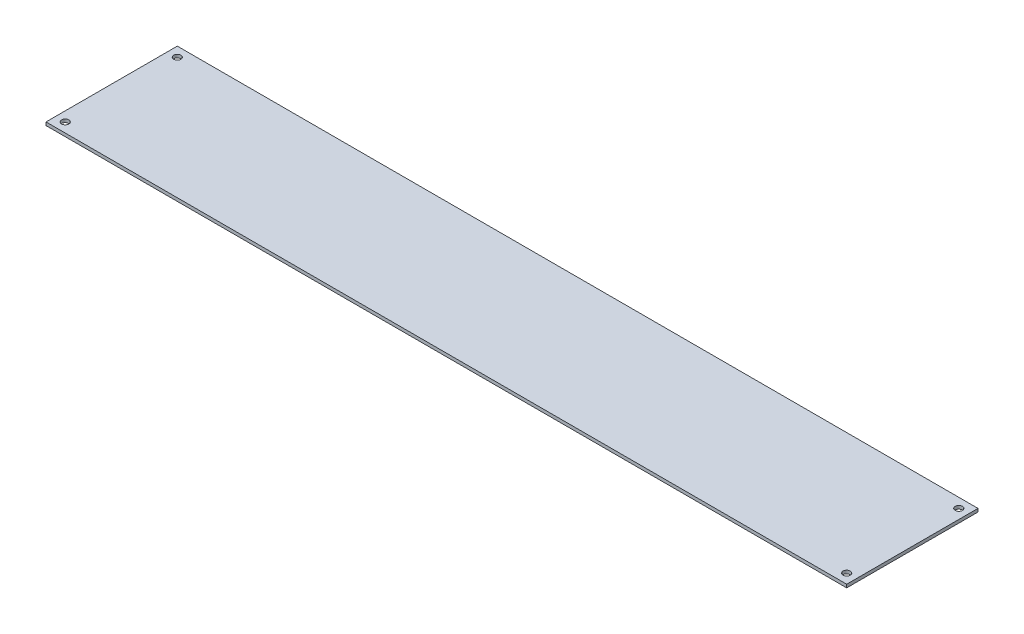
ISO-10303-21;
HEADER;
FILE_DESCRIPTION(('STEP AP214'),'2;1');
FILE_NAME('part.step','',(''),(''),'','','');
FILE_SCHEMA(('AUTOMOTIVE_DESIGN { 1 0 10303 214 1 1 1 1 }'));
ENDSEC;
DATA;
#1=APPLICATION_CONTEXT('core data for automotive mechanical design processes');
#2=APPLICATION_PROTOCOL_DEFINITION('international standard','automotive_design',2000,#1);
#3=PRODUCT_CONTEXT('',#1,'mechanical');
#4=PRODUCT('Part','Part','',(#3));
#5=PRODUCT_RELATED_PRODUCT_CATEGORY('part','',(#4));
#6=PRODUCT_DEFINITION_FORMATION('','',#4);
#7=PRODUCT_DEFINITION_CONTEXT('part definition',#1,'design');
#8=PRODUCT_DEFINITION('design','',#6,#7);
#9=PRODUCT_DEFINITION_SHAPE('','',#8);
#10=(LENGTH_UNIT() NAMED_UNIT(*) SI_UNIT(.MILLI.,.METRE.));
#11=(NAMED_UNIT(*) PLANE_ANGLE_UNIT() SI_UNIT($,.RADIAN.));
#12=(NAMED_UNIT(*) SI_UNIT($,.STERADIAN.) SOLID_ANGLE_UNIT());
#13=UNCERTAINTY_MEASURE_WITH_UNIT(LENGTH_MEASURE(1.E-05),#10,'distance_accuracy_value','');
#14=(GEOMETRIC_REPRESENTATION_CONTEXT(3) GLOBAL_UNCERTAINTY_ASSIGNED_CONTEXT((#13)) GLOBAL_UNIT_ASSIGNED_CONTEXT((#10,
#11,#12)) REPRESENTATION_CONTEXT('',''));
#15=CARTESIAN_POINT('',(0.,0.,0.));
#16=DIRECTION('',(0.,0.,1.));
#17=DIRECTION('',(1.,0.,0.));
#18=AXIS2_PLACEMENT_3D('',#15,#16,#17);
#19=CARTESIAN_POINT('',(0.,2.,0.));
#20=DIRECTION('',(1.,0.,0.));
#21=DIRECTION('',(0.,0.,-1.));
#22=AXIS2_PLACEMENT_3D('',#19,#20,#21);
#23=PLANE('',#22);
#24=DIRECTION('',(0.,0.,1.));
#25=VECTOR('',#24,1.);
#26=CARTESIAN_POINT('',(0.,0.,0.));
#27=LINE('',#26,#25);
#28=CARTESIAN_POINT('',(0.,0.,-82.));
#29=VERTEX_POINT('',#28);
#30=CARTESIAN_POINT('',(0.,0.,0.));
#31=VERTEX_POINT('',#30);
#32=EDGE_CURVE('E97',#29,#31,#27,.T.);
#33=ORIENTED_EDGE('',*,*,#32,.T.);
#34=DIRECTION('',(0.,-1.,0.));
#35=VECTOR('',#34,1.);
#36=CARTESIAN_POINT('',(0.,2.,0.));
#37=LINE('',#36,#35);
#38=CARTESIAN_POINT('',(0.,2.,0.));
#39=VERTEX_POINT('',#38);
#40=EDGE_CURVE('E11',#39,#31,#37,.T.);
#41=ORIENTED_EDGE('',*,*,#40,.F.);
#42=DIRECTION('',(0.,0.,1.));
#43=VECTOR('',#42,1.);
#44=CARTESIAN_POINT('',(0.,2.,0.));
#45=LINE('',#44,#43);
#46=CARTESIAN_POINT('',(0.,2.,-82.));
#47=VERTEX_POINT('',#46);
#48=EDGE_CURVE('E85',#47,#39,#45,.T.);
#49=ORIENTED_EDGE('',*,*,#48,.F.);
#50=DIRECTION('',(0.,-1.,0.));
#51=VECTOR('',#50,1.);
#52=CARTESIAN_POINT('',(0.,2.,-82.));
#53=LINE('',#52,#51);
#54=EDGE_CURVE('E93',#47,#29,#53,.T.);
#55=ORIENTED_EDGE('',*,*,#54,.T.);
#56=EDGE_LOOP('',(#33,#41,#49,#55));
#57=FACE_BOUND('',#56,.T.);
#58=ADVANCED_FACE('F34',(#57),#23,.F.);
#59=CARTESIAN_POINT('',(0.,2.,0.));
#60=DIRECTION('',(0.,0.,-1.));
#61=DIRECTION('',(-1.,0.,0.));
#62=AXIS2_PLACEMENT_3D('',#59,#60,#61);
#63=PLANE('',#62);
#64=DIRECTION('',(1.,0.,0.));
#65=VECTOR('',#64,1.);
#66=CARTESIAN_POINT('',(0.,0.,0.));
#67=LINE('',#66,#65);
#68=CARTESIAN_POINT('',(500.,0.,0.));
#69=VERTEX_POINT('',#68);
#70=EDGE_CURVE('E89',#31,#69,#67,.T.);
#71=ORIENTED_EDGE('',*,*,#70,.T.);
#72=DIRECTION('',(0.,-1.,0.));
#73=VECTOR('',#72,1.);
#74=CARTESIAN_POINT('',(500.,2.,0.));
#75=LINE('',#74,#73);
#76=CARTESIAN_POINT('',(500.,2.,0.));
#77=VERTEX_POINT('',#76);
#78=EDGE_CURVE('E42',#77,#69,#75,.T.);
#79=ORIENTED_EDGE('',*,*,#78,.F.);
#80=DIRECTION('',(1.,0.,0.));
#81=VECTOR('',#80,1.);
#82=CARTESIAN_POINT('',(0.,2.,0.));
#83=LINE('',#82,#81);
#84=EDGE_CURVE('E80',#39,#77,#83,.T.);
#85=ORIENTED_EDGE('',*,*,#84,.F.);
#86=ORIENTED_EDGE('',*,*,#40,.T.);
#87=EDGE_LOOP('',(#71,#79,#85,#86));
#88=FACE_BOUND('',#87,.T.);
#89=ADVANCED_FACE('F88',(#88),#63,.F.);
#90=CARTESIAN_POINT('',(500.,2.,0.));
#91=DIRECTION('',(-1.,0.,0.));
#92=DIRECTION('',(0.,0.,1.));
#93=AXIS2_PLACEMENT_3D('',#90,#91,#92);
#94=PLANE('',#93);
#95=DIRECTION('',(0.,0.,-1.));
#96=VECTOR('',#95,1.);
#97=CARTESIAN_POINT('',(500.,0.,0.));
#98=LINE('',#97,#96);
#99=CARTESIAN_POINT('',(500.,0.,-82.));
#100=VERTEX_POINT('',#99);
#101=EDGE_CURVE('E67',#69,#100,#98,.T.);
#102=ORIENTED_EDGE('',*,*,#101,.T.);
#103=DIRECTION('',(0.,-1.,0.));
#104=VECTOR('',#103,1.);
#105=CARTESIAN_POINT('',(500.,2.,-82.));
#106=LINE('',#105,#104);
#107=CARTESIAN_POINT('',(500.,2.,-82.));
#108=VERTEX_POINT('',#107);
#109=EDGE_CURVE('E90',#108,#100,#106,.T.);
#110=ORIENTED_EDGE('',*,*,#109,.F.);
#111=DIRECTION('',(0.,0.,-1.));
#112=VECTOR('',#111,1.);
#113=CARTESIAN_POINT('',(500.,2.,0.));
#114=LINE('',#113,#112);
#115=EDGE_CURVE('E83',#77,#108,#114,.T.);
#116=ORIENTED_EDGE('',*,*,#115,.F.);
#117=ORIENTED_EDGE('',*,*,#78,.T.);
#118=EDGE_LOOP('',(#102,#110,#116,#117));
#119=FACE_BOUND('',#118,.T.);
#120=ADVANCED_FACE('F91',(#119),#94,.F.);
#121=CARTESIAN_POINT('',(0.,2.,-82.));
#122=DIRECTION('',(0.,0.,1.));
#123=DIRECTION('',(1.,0.,0.));
#124=AXIS2_PLACEMENT_3D('',#121,#122,#123);
#125=PLANE('',#124);
#126=DIRECTION('',(-1.,0.,0.));
#127=VECTOR('',#126,1.);
#128=CARTESIAN_POINT('',(0.,0.,-82.));
#129=LINE('',#128,#127);
#130=EDGE_CURVE('E73',#100,#29,#129,.T.);
#131=ORIENTED_EDGE('',*,*,#130,.T.);
#132=ORIENTED_EDGE('',*,*,#54,.F.);
#133=DIRECTION('',(-1.,0.,0.));
#134=VECTOR('',#133,1.);
#135=CARTESIAN_POINT('',(0.,2.,-82.));
#136=LINE('',#135,#134);
#137=EDGE_CURVE('E50',#108,#47,#136,.T.);
#138=ORIENTED_EDGE('',*,*,#137,.F.);
#139=ORIENTED_EDGE('',*,*,#109,.T.);
#140=EDGE_LOOP('',(#131,#132,#138,#139));
#141=FACE_BOUND('',#140,.T.);
#142=ADVANCED_FACE('F105',(#141),#125,.F.);
#143=CARTESIAN_POINT('',(0.,2.,0.));
#144=DIRECTION('',(0.,-1.,0.));
#145=DIRECTION('',(0.,0.,-1.));
#146=AXIS2_PLACEMENT_3D('',#143,#144,#145);
#147=PLANE('',#146);
#148=CARTESIAN_POINT('',(6.00000000000001,2.,-6.));
#149=DIRECTION('',(0.,-1.,0.));
#150=DIRECTION('',(0.,0.,-1.));
#151=AXIS2_PLACEMENT_3D('',#148,#149,#150);
#152=CIRCLE('',#151,2.25);
#153=CARTESIAN_POINT('',(6.00000000000001,2.,-8.25));
#154=VERTEX_POINT('',#153);
#155=EDGE_CURVE('E128',#154,#154,#152,.T.);
#156=ORIENTED_EDGE('',*,*,#155,.T.);
#157=EDGE_LOOP('',(#156));
#158=FACE_BOUND('',#157,.T.);
#159=CARTESIAN_POINT('',(6.00000000000001,2.,-76.));
#160=DIRECTION('',(0.,-1.,0.));
#161=DIRECTION('',(0.,0.,-1.));
#162=AXIS2_PLACEMENT_3D('',#159,#160,#161);
#163=CIRCLE('',#162,2.25);
#164=CARTESIAN_POINT('',(6.00000000000001,2.,-78.25));
#165=VERTEX_POINT('',#164);
#166=EDGE_CURVE('E122',#165,#165,#163,.T.);
#167=ORIENTED_EDGE('',*,*,#166,.T.);
#168=EDGE_LOOP('',(#167));
#169=FACE_BOUND('',#168,.T.);
#170=CARTESIAN_POINT('',(494.,2.,-76.));
#171=DIRECTION('',(0.,-1.,0.));
#172=DIRECTION('',(0.,0.,-1.));
#173=AXIS2_PLACEMENT_3D('',#170,#171,#172);
#174=CIRCLE('',#173,2.24999999999997);
#175=CARTESIAN_POINT('',(494.,2.,-78.25));
#176=VERTEX_POINT('',#175);
#177=EDGE_CURVE('E116',#176,#176,#174,.T.);
#178=ORIENTED_EDGE('',*,*,#177,.T.);
#179=EDGE_LOOP('',(#178));
#180=FACE_BOUND('',#179,.T.);
#181=CARTESIAN_POINT('',(494.,2.,-6.));
#182=DIRECTION('',(0.,-1.,0.));
#183=DIRECTION('',(0.,0.,-1.));
#184=AXIS2_PLACEMENT_3D('',#181,#182,#183);
#185=CIRCLE('',#184,2.24999999999997);
#186=CARTESIAN_POINT('',(494.,2.,-8.24999999999998));
#187=VERTEX_POINT('',#186);
#188=EDGE_CURVE('E100',#187,#187,#185,.T.);
#189=ORIENTED_EDGE('',*,*,#188,.T.);
#190=EDGE_LOOP('',(#189));
#191=FACE_BOUND('',#190,.T.);
#192=ORIENTED_EDGE('',*,*,#48,.T.);
#193=ORIENTED_EDGE('',*,*,#84,.T.);
#194=ORIENTED_EDGE('',*,*,#115,.T.);
#195=ORIENTED_EDGE('',*,*,#137,.T.);
#196=EDGE_LOOP('',(#192,#193,#194,#195));
#197=FACE_BOUND('',#196,.T.);
#198=ADVANCED_FACE('F81',(#158,#169,#180,#191,#197),#147,.F.);
#199=CARTESIAN_POINT('',(0.,0.,0.));
#200=DIRECTION('',(0.,-1.,0.));
#201=DIRECTION('',(0.,0.,-1.));
#202=AXIS2_PLACEMENT_3D('',#199,#200,#201);
#203=PLANE('',#202);
#204=CARTESIAN_POINT('',(6.00000000000001,0.,-6.));
#205=DIRECTION('',(0.,-1.,0.));
#206=DIRECTION('',(0.,0.,-1.));
#207=AXIS2_PLACEMENT_3D('',#204,#205,#206);
#208=CIRCLE('',#207,2.25);
#209=CARTESIAN_POINT('',(6.00000000000001,0.,-8.25));
#210=VERTEX_POINT('',#209);
#211=EDGE_CURVE('E131',#210,#210,#208,.T.);
#212=ORIENTED_EDGE('',*,*,#211,.F.);
#213=EDGE_LOOP('',(#212));
#214=FACE_BOUND('',#213,.T.);
#215=CARTESIAN_POINT('',(6.00000000000001,0.,-76.));
#216=DIRECTION('',(0.,-1.,0.));
#217=DIRECTION('',(0.,0.,-1.));
#218=AXIS2_PLACEMENT_3D('',#215,#216,#217);
#219=CIRCLE('',#218,2.25);
#220=CARTESIAN_POINT('',(6.00000000000001,0.,-78.25));
#221=VERTEX_POINT('',#220);
#222=EDGE_CURVE('E125',#221,#221,#219,.T.);
#223=ORIENTED_EDGE('',*,*,#222,.F.);
#224=EDGE_LOOP('',(#223));
#225=FACE_BOUND('',#224,.T.);
#226=CARTESIAN_POINT('',(494.,0.,-76.));
#227=DIRECTION('',(0.,-1.,0.));
#228=DIRECTION('',(0.,0.,-1.));
#229=AXIS2_PLACEMENT_3D('',#226,#227,#228);
#230=CIRCLE('',#229,2.24999999999997);
#231=CARTESIAN_POINT('',(494.,0.,-78.25));
#232=VERTEX_POINT('',#231);
#233=EDGE_CURVE('E119',#232,#232,#230,.T.);
#234=ORIENTED_EDGE('',*,*,#233,.F.);
#235=EDGE_LOOP('',(#234));
#236=FACE_BOUND('',#235,.T.);
#237=CARTESIAN_POINT('',(494.,0.,-6.));
#238=DIRECTION('',(0.,-1.,0.));
#239=DIRECTION('',(0.,0.,-1.));
#240=AXIS2_PLACEMENT_3D('',#237,#238,#239);
#241=CIRCLE('',#240,2.24999999999997);
#242=CARTESIAN_POINT('',(494.,0.,-8.24999999999998));
#243=VERTEX_POINT('',#242);
#244=EDGE_CURVE('E113',#243,#243,#241,.T.);
#245=ORIENTED_EDGE('',*,*,#244,.F.);
#246=EDGE_LOOP('',(#245));
#247=FACE_BOUND('',#246,.T.);
#248=ORIENTED_EDGE('',*,*,#32,.F.);
#249=ORIENTED_EDGE('',*,*,#130,.F.);
#250=ORIENTED_EDGE('',*,*,#101,.F.);
#251=ORIENTED_EDGE('',*,*,#70,.F.);
#252=EDGE_LOOP('',(#248,#249,#250,#251));
#253=FACE_BOUND('',#252,.T.);
#254=ADVANCED_FACE('F108',(#214,#225,#236,#247,#253),#203,.T.);
#255=CARTESIAN_POINT('',(494.,0.,-6.));
#256=DIRECTION('',(0.,-1.,0.));
#257=DIRECTION('',(0.,0.,-1.));
#258=AXIS2_PLACEMENT_3D('',#255,#256,#257);
#259=CYLINDRICAL_SURFACE('',#258,2.24999999999997);
#260=ORIENTED_EDGE('',*,*,#188,.F.);
#261=EDGE_LOOP('',(#260));
#262=FACE_BOUND('',#261,.T.);
#263=ORIENTED_EDGE('',*,*,#244,.T.);
#264=EDGE_LOOP('',(#263));
#265=FACE_BOUND('',#264,.T.);
#266=ADVANCED_FACE('F139',(#262,#265),#259,.F.);
#267=CARTESIAN_POINT('',(494.,0.,-76.));
#268=DIRECTION('',(0.,-1.,0.));
#269=DIRECTION('',(0.,0.,-1.));
#270=AXIS2_PLACEMENT_3D('',#267,#268,#269);
#271=CYLINDRICAL_SURFACE('',#270,2.24999999999997);
#272=ORIENTED_EDGE('',*,*,#177,.F.);
#273=EDGE_LOOP('',(#272));
#274=FACE_BOUND('',#273,.T.);
#275=ORIENTED_EDGE('',*,*,#233,.T.);
#276=EDGE_LOOP('',(#275));
#277=FACE_BOUND('',#276,.T.);
#278=ADVANCED_FACE('F148',(#274,#277),#271,.F.);
#279=CARTESIAN_POINT('',(6.00000000000001,0.,-76.));
#280=DIRECTION('',(0.,-1.,0.));
#281=DIRECTION('',(0.,0.,-1.));
#282=AXIS2_PLACEMENT_3D('',#279,#280,#281);
#283=CYLINDRICAL_SURFACE('',#282,2.25);
#284=ORIENTED_EDGE('',*,*,#166,.F.);
#285=EDGE_LOOP('',(#284));
#286=FACE_BOUND('',#285,.T.);
#287=ORIENTED_EDGE('',*,*,#222,.T.);
#288=EDGE_LOOP('',(#287));
#289=FACE_BOUND('',#288,.T.);
#290=ADVANCED_FACE('F154',(#286,#289),#283,.F.);
#291=CARTESIAN_POINT('',(6.00000000000001,0.,-6.));
#292=DIRECTION('',(0.,-1.,0.));
#293=DIRECTION('',(0.,0.,-1.));
#294=AXIS2_PLACEMENT_3D('',#291,#292,#293);
#295=CYLINDRICAL_SURFACE('',#294,2.25);
#296=ORIENTED_EDGE('',*,*,#155,.F.);
#297=EDGE_LOOP('',(#296));
#298=FACE_BOUND('',#297,.T.);
#299=ORIENTED_EDGE('',*,*,#211,.T.);
#300=EDGE_LOOP('',(#299));
#301=FACE_BOUND('',#300,.T.);
#302=ADVANCED_FACE('F135',(#298,#301),#295,.F.);
#303=CLOSED_SHELL('',(#58,#89,#120,#142,#198,#254,#266,#278,#290,#302));
#304=MANIFOLD_SOLID_BREP('B2',#303);
#305=ADVANCED_BREP_SHAPE_REPRESENTATION('',(#18,#304),#14);
#306=SHAPE_DEFINITION_REPRESENTATION(#9,#305);
ENDSEC;
END-ISO-10303-21;
